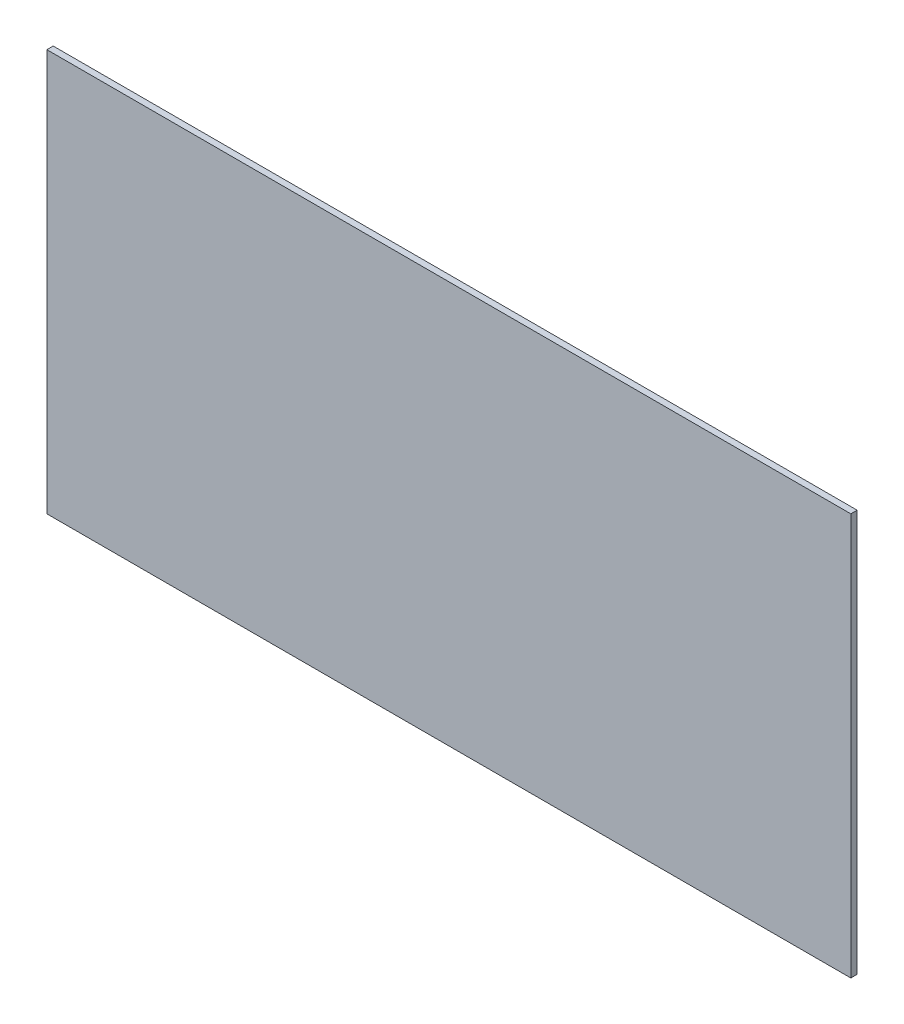
ISO-10303-21;
HEADER;
FILE_DESCRIPTION(('STEP AP214'),'2;1');
FILE_NAME('part.step','',(''),(''),'','','');
FILE_SCHEMA(('AUTOMOTIVE_DESIGN { 1 0 10303 214 1 1 1 1 }'));
ENDSEC;
DATA;
#1=APPLICATION_CONTEXT('core data for automotive mechanical design processes');
#2=APPLICATION_PROTOCOL_DEFINITION('international standard','automotive_design',2000,#1);
#3=PRODUCT_CONTEXT('',#1,'mechanical');
#4=PRODUCT('Part','Part','',(#3));
#5=PRODUCT_RELATED_PRODUCT_CATEGORY('part','',(#4));
#6=PRODUCT_DEFINITION_FORMATION('','',#4);
#7=PRODUCT_DEFINITION_CONTEXT('part definition',#1,'design');
#8=PRODUCT_DEFINITION('design','',#6,#7);
#9=PRODUCT_DEFINITION_SHAPE('','',#8);
#10=(LENGTH_UNIT() NAMED_UNIT(*) SI_UNIT(.MILLI.,.METRE.));
#11=(NAMED_UNIT(*) PLANE_ANGLE_UNIT() SI_UNIT($,.RADIAN.));
#12=(NAMED_UNIT(*) SI_UNIT($,.STERADIAN.) SOLID_ANGLE_UNIT());
#13=UNCERTAINTY_MEASURE_WITH_UNIT(LENGTH_MEASURE(1.E-05),#10,'distance_accuracy_value','');
#14=(GEOMETRIC_REPRESENTATION_CONTEXT(3) GLOBAL_UNCERTAINTY_ASSIGNED_CONTEXT((#13)) GLOBAL_UNIT_ASSIGNED_CONTEXT((#10,
#11,#12)) REPRESENTATION_CONTEXT('',''));
#15=CARTESIAN_POINT('',(0.,0.,0.));
#16=DIRECTION('',(0.,0.,1.));
#17=DIRECTION('',(1.,0.,0.));
#18=AXIS2_PLACEMENT_3D('',#15,#16,#17);
#19=CARTESIAN_POINT('',(0.,0.,0.));
#20=DIRECTION('',(0.,0.,1.));
#21=DIRECTION('',(1.,0.,0.));
#22=AXIS2_PLACEMENT_3D('',#19,#20,#21);
#23=PLANE('',#22);
#24=DIRECTION('',(1.,0.,0.));
#25=VECTOR('',#24,1.);
#26=CARTESIAN_POINT('',(6.35,3.175,0.));
#27=LINE('',#26,#25);
#28=CARTESIAN_POINT('',(6.35,3.175,0.));
#29=VERTEX_POINT('',#28);
#30=CARTESIAN_POINT('',(-6.35,3.175,0.));
#31=VERTEX_POINT('',#30);
#32=EDGE_CURVE('E79',#29,#31,#27,.F.);
#33=ORIENTED_EDGE('',*,*,#32,.F.);
#34=DIRECTION('',(0.,1.,0.));
#35=VECTOR('',#34,1.);
#36=CARTESIAN_POINT('',(6.35,-3.175,0.));
#37=LINE('',#36,#35);
#38=CARTESIAN_POINT('',(6.35,-3.175,0.));
#39=VERTEX_POINT('',#38);
#40=EDGE_CURVE('E55',#39,#29,#37,.T.);
#41=ORIENTED_EDGE('',*,*,#40,.F.);
#42=DIRECTION('',(1.,0.,0.));
#43=VECTOR('',#42,1.);
#44=CARTESIAN_POINT('',(-6.35,-3.175,0.));
#45=LINE('',#44,#43);
#46=CARTESIAN_POINT('',(-6.35,-3.175,0.));
#47=VERTEX_POINT('',#46);
#48=EDGE_CURVE('E57',#47,#39,#45,.T.);
#49=ORIENTED_EDGE('',*,*,#48,.F.);
#50=DIRECTION('',(0.,1.,0.));
#51=VECTOR('',#50,1.);
#52=CARTESIAN_POINT('',(-6.35,3.175,0.));
#53=LINE('',#52,#51);
#54=EDGE_CURVE('E20',#31,#47,#53,.F.);
#55=ORIENTED_EDGE('',*,*,#54,.F.);
#56=EDGE_LOOP('',(#33,#41,#49,#55));
#57=FACE_BOUND('',#56,.T.);
#58=ADVANCED_FACE('F17',(#57),#23,.F.);
#59=CARTESIAN_POINT('',(-6.35,3.175,0.));
#60=DIRECTION('',(-1.,0.,0.));
#61=DIRECTION('',(0.,0.,1.));
#62=AXIS2_PLACEMENT_3D('',#59,#60,#61);
#63=PLANE('',#62);
#64=DIRECTION('',(0.,1.,0.));
#65=VECTOR('',#64,1.);
#66=CARTESIAN_POINT('',(-6.35,0.,0.1));
#67=LINE('',#66,#65);
#68=CARTESIAN_POINT('',(-6.35,3.175,0.1));
#69=VERTEX_POINT('',#68);
#70=CARTESIAN_POINT('',(-6.35,-3.175,0.1));
#71=VERTEX_POINT('',#70);
#72=EDGE_CURVE('E83',#69,#71,#67,.F.);
#73=ORIENTED_EDGE('',*,*,#72,.F.);
#74=DIRECTION('',(0.,0.,1.));
#75=VECTOR('',#74,1.);
#76=CARTESIAN_POINT('',(-6.35,3.175,0.));
#77=LINE('',#76,#75);
#78=EDGE_CURVE('E68',#31,#69,#77,.T.);
#79=ORIENTED_EDGE('',*,*,#78,.F.);
#80=ORIENTED_EDGE('',*,*,#54,.T.);
#81=DIRECTION('',(0.,0.,-1.));
#82=VECTOR('',#81,1.);
#83=CARTESIAN_POINT('',(-6.35,-3.175,0.));
#84=LINE('',#83,#82);
#85=EDGE_CURVE('E63',#71,#47,#84,.T.);
#86=ORIENTED_EDGE('',*,*,#85,.F.);
#87=EDGE_LOOP('',(#73,#79,#80,#86));
#88=FACE_BOUND('',#87,.T.);
#89=ADVANCED_FACE('F65',(#88),#63,.T.);
#90=CARTESIAN_POINT('',(-6.35,-3.175,0.));
#91=DIRECTION('',(0.,-1.,0.));
#92=DIRECTION('',(0.,0.,-1.));
#93=AXIS2_PLACEMENT_3D('',#90,#91,#92);
#94=PLANE('',#93);
#95=DIRECTION('',(1.,0.,0.));
#96=VECTOR('',#95,1.);
#97=CARTESIAN_POINT('',(0.,-3.175,0.1));
#98=LINE('',#97,#96);
#99=CARTESIAN_POINT('',(6.35,-3.175,0.1));
#100=VERTEX_POINT('',#99);
#101=EDGE_CURVE('E72',#71,#100,#98,.T.);
#102=ORIENTED_EDGE('',*,*,#101,.F.);
#103=ORIENTED_EDGE('',*,*,#85,.T.);
#104=ORIENTED_EDGE('',*,*,#48,.T.);
#105=DIRECTION('',(0.,0.,-1.));
#106=VECTOR('',#105,1.);
#107=CARTESIAN_POINT('',(6.35,-3.175,0.));
#108=LINE('',#107,#106);
#109=EDGE_CURVE('E75',#100,#39,#108,.T.);
#110=ORIENTED_EDGE('',*,*,#109,.F.);
#111=EDGE_LOOP('',(#102,#103,#104,#110));
#112=FACE_BOUND('',#111,.T.);
#113=ADVANCED_FACE('F70',(#112),#94,.T.);
#114=CARTESIAN_POINT('',(6.35,-3.175,0.));
#115=DIRECTION('',(1.,0.,0.));
#116=DIRECTION('',(0.,0.,-1.));
#117=AXIS2_PLACEMENT_3D('',#114,#115,#116);
#118=PLANE('',#117);
#119=DIRECTION('',(0.,1.,0.));
#120=VECTOR('',#119,1.);
#121=CARTESIAN_POINT('',(6.35,0.,0.1));
#122=LINE('',#121,#120);
#123=CARTESIAN_POINT('',(6.35,3.175,0.1));
#124=VERTEX_POINT('',#123);
#125=EDGE_CURVE('E26',#100,#124,#122,.T.);
#126=ORIENTED_EDGE('',*,*,#125,.F.);
#127=ORIENTED_EDGE('',*,*,#109,.T.);
#128=ORIENTED_EDGE('',*,*,#40,.T.);
#129=DIRECTION('',(0.,0.,1.));
#130=VECTOR('',#129,1.);
#131=CARTESIAN_POINT('',(6.35,3.175,0.));
#132=LINE('',#131,#130);
#133=EDGE_CURVE('E35',#124,#29,#132,.F.);
#134=ORIENTED_EDGE('',*,*,#133,.F.);
#135=EDGE_LOOP('',(#126,#127,#128,#134));
#136=FACE_BOUND('',#135,.T.);
#137=ADVANCED_FACE('F89',(#136),#118,.T.);
#138=CARTESIAN_POINT('',(6.35,3.175,0.));
#139=DIRECTION('',(0.,1.,0.));
#140=DIRECTION('',(0.,0.,1.));
#141=AXIS2_PLACEMENT_3D('',#138,#139,#140);
#142=PLANE('',#141);
#143=DIRECTION('',(1.,0.,0.));
#144=VECTOR('',#143,1.);
#145=CARTESIAN_POINT('',(0.,3.175,0.1));
#146=LINE('',#145,#144);
#147=EDGE_CURVE('E11',#124,#69,#146,.F.);
#148=ORIENTED_EDGE('',*,*,#147,.F.);
#149=ORIENTED_EDGE('',*,*,#133,.T.);
#150=ORIENTED_EDGE('',*,*,#32,.T.);
#151=ORIENTED_EDGE('',*,*,#78,.T.);
#152=EDGE_LOOP('',(#148,#149,#150,#151));
#153=FACE_BOUND('',#152,.T.);
#154=ADVANCED_FACE('F91',(#153),#142,.T.);
#155=CARTESIAN_POINT('',(0.,0.,0.1));
#156=DIRECTION('',(0.,0.,1.));
#157=DIRECTION('',(1.,0.,0.));
#158=AXIS2_PLACEMENT_3D('',#155,#156,#157);
#159=PLANE('',#158);
#160=ORIENTED_EDGE('',*,*,#125,.T.);
#161=ORIENTED_EDGE('',*,*,#147,.T.);
#162=ORIENTED_EDGE('',*,*,#72,.T.);
#163=ORIENTED_EDGE('',*,*,#101,.T.);
#164=EDGE_LOOP('',(#160,#161,#162,#163));
#165=FACE_BOUND('',#164,.T.);
#166=ADVANCED_FACE('F88',(#165),#159,.T.);
#167=CLOSED_SHELL('',(#58,#89,#113,#137,#154,#166));
#168=MANIFOLD_SOLID_BREP('B1',#167);
#169=ADVANCED_BREP_SHAPE_REPRESENTATION('',(#18,#168),#14);
#170=SHAPE_DEFINITION_REPRESENTATION(#9,#169);
ENDSEC;
END-ISO-10303-21;
